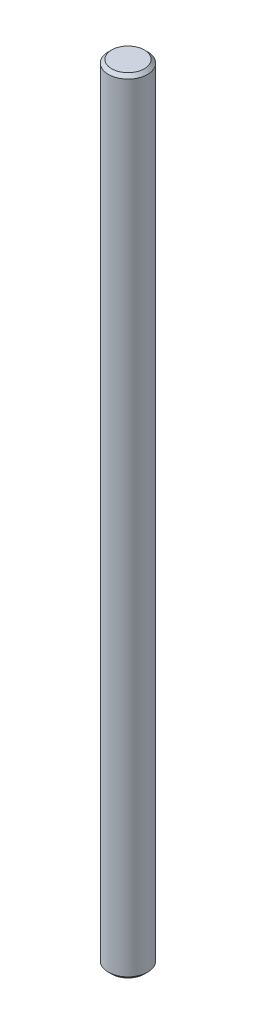
ISO-10303-21;
HEADER;
FILE_DESCRIPTION(('STEP AP214'),'2;1');
FILE_NAME('part.step','',(''),(''),'','','');
FILE_SCHEMA(('AUTOMOTIVE_DESIGN { 1 0 10303 214 1 1 1 1 }'));
ENDSEC;
DATA;
#1=APPLICATION_CONTEXT('core data for automotive mechanical design processes');
#2=APPLICATION_PROTOCOL_DEFINITION('international standard','automotive_design',2000,#1);
#3=PRODUCT_CONTEXT('',#1,'mechanical');
#4=PRODUCT('Part','Part','',(#3));
#5=PRODUCT_RELATED_PRODUCT_CATEGORY('part','',(#4));
#6=PRODUCT_DEFINITION_FORMATION('','',#4);
#7=PRODUCT_DEFINITION_CONTEXT('part definition',#1,'design');
#8=PRODUCT_DEFINITION('design','',#6,#7);
#9=PRODUCT_DEFINITION_SHAPE('','',#8);
#10=(LENGTH_UNIT() NAMED_UNIT(*) SI_UNIT(.MILLI.,.METRE.));
#11=(NAMED_UNIT(*) PLANE_ANGLE_UNIT() SI_UNIT($,.RADIAN.));
#12=(NAMED_UNIT(*) SI_UNIT($,.STERADIAN.) SOLID_ANGLE_UNIT());
#13=UNCERTAINTY_MEASURE_WITH_UNIT(LENGTH_MEASURE(1.E-05),#10,'distance_accuracy_value','');
#14=(GEOMETRIC_REPRESENTATION_CONTEXT(3) GLOBAL_UNCERTAINTY_ASSIGNED_CONTEXT((#13)) GLOBAL_UNIT_ASSIGNED_CONTEXT((#10,
#11,#12)) REPRESENTATION_CONTEXT('',''));
#15=CARTESIAN_POINT('',(0.,0.,0.));
#16=DIRECTION('',(0.,0.,1.));
#17=DIRECTION('',(1.,0.,0.));
#18=AXIS2_PLACEMENT_3D('',#15,#16,#17);
#19=CARTESIAN_POINT('',(0.,240.,-0.0104188651304302));
#20=DIRECTION('',(0.,-1.,0.));
#21=DIRECTION('',(0.,0.,-1.));
#22=AXIS2_PLACEMENT_3D('',#19,#20,#21);
#23=CYLINDRICAL_SURFACE('',#22,6.);
#24=CARTESIAN_POINT('',(0.,239.,-0.0104188651304302));
#25=DIRECTION('',(0.,1.,0.));
#26=DIRECTION('',(0.,0.,1.));
#27=AXIS2_PLACEMENT_3D('',#24,#25,#26);
#28=CIRCLE('',#27,6.);
#29=CARTESIAN_POINT('',(0.,239.,5.98958113486957));
#30=VERTEX_POINT('',#29);
#31=EDGE_CURVE('E37',#30,#30,#28,.F.);
#32=ORIENTED_EDGE('',*,*,#31,.T.);
#33=EDGE_LOOP('',(#32));
#34=FACE_BOUND('',#33,.T.);
#35=CARTESIAN_POINT('',(0.,0.999999999999945,-0.0104188651304302));
#36=DIRECTION('',(0.,1.,0.));
#37=DIRECTION('',(0.,0.,1.));
#38=AXIS2_PLACEMENT_3D('',#35,#36,#37);
#39=CIRCLE('',#38,6.);
#40=CARTESIAN_POINT('',(0.,0.999999999999945,5.98958113486957));
#41=VERTEX_POINT('',#40);
#42=EDGE_CURVE('E41',#41,#41,#39,.T.);
#43=ORIENTED_EDGE('',*,*,#42,.T.);
#44=EDGE_LOOP('',(#43));
#45=FACE_BOUND('',#44,.T.);
#46=ADVANCED_FACE('F30',(#34,#45),#23,.T.);
#47=CARTESIAN_POINT('',(0.,240.,-0.0104188651304302));
#48=DIRECTION('',(0.,1.,0.));
#49=DIRECTION('',(0.,0.,1.));
#50=AXIS2_PLACEMENT_3D('',#47,#48,#49);
#51=PLANE('',#50);
#52=CARTESIAN_POINT('',(0.,240.,-0.0104188651304302));
#53=DIRECTION('',(0.,1.,0.));
#54=DIRECTION('',(0.,0.,1.));
#55=AXIS2_PLACEMENT_3D('',#52,#53,#54);
#56=CIRCLE('',#55,5.00000000000003);
#57=CARTESIAN_POINT('',(0.,240.,4.9895811348696));
#58=VERTEX_POINT('',#57);
#59=EDGE_CURVE('E45',#58,#58,#56,.T.);
#60=ORIENTED_EDGE('',*,*,#59,.T.);
#61=EDGE_LOOP('',(#60));
#62=FACE_BOUND('',#61,.T.);
#63=ADVANCED_FACE('F51',(#62),#51,.T.);
#64=CARTESIAN_POINT('',(0.,0.,-0.0104188651304302));
#65=DIRECTION('',(0.,1.,0.));
#66=DIRECTION('',(0.,0.,1.));
#67=AXIS2_PLACEMENT_3D('',#64,#65,#66);
#68=PLANE('',#67);
#69=CARTESIAN_POINT('',(0.,0.,-0.0104188651304302));
#70=DIRECTION('',(0.,1.,0.));
#71=DIRECTION('',(0.,0.,1.));
#72=AXIS2_PLACEMENT_3D('',#69,#70,#71);
#73=CIRCLE('',#72,5.00000000000003);
#74=CARTESIAN_POINT('',(0.,0.,4.9895811348696));
#75=VERTEX_POINT('',#74);
#76=EDGE_CURVE('E10',#75,#75,#73,.F.);
#77=ORIENTED_EDGE('',*,*,#76,.T.);
#78=EDGE_LOOP('',(#77));
#79=FACE_BOUND('',#78,.T.);
#80=ADVANCED_FACE('F55',(#79),#68,.F.);
#81=CARTESIAN_POINT('',(0.,240.,-0.0104188651304302));
#82=DIRECTION('',(0.,-1.,0.));
#83=DIRECTION('',(0.,0.,-1.));
#84=AXIS2_PLACEMENT_3D('',#81,#82,#83);
#85=CONICAL_SURFACE('',#84,5.00000000000003,0.785398163397432);
#86=ORIENTED_EDGE('',*,*,#31,.F.);
#87=EDGE_LOOP('',(#86));
#88=FACE_BOUND('',#87,.T.);
#89=ORIENTED_EDGE('',*,*,#59,.F.);
#90=EDGE_LOOP('',(#89));
#91=FACE_BOUND('',#90,.T.);
#92=ADVANCED_FACE('F53',(#88,#91),#85,.T.);
#93=CARTESIAN_POINT('',(0.,0.999999999999945,-0.0104188651304302));
#94=DIRECTION('',(0.,1.,0.));
#95=DIRECTION('',(0.,0.,1.));
#96=AXIS2_PLACEMENT_3D('',#93,#94,#95);
#97=CONICAL_SURFACE('',#96,6.,0.78539816339746);
#98=ORIENTED_EDGE('',*,*,#76,.F.);
#99=EDGE_LOOP('',(#98));
#100=FACE_BOUND('',#99,.T.);
#101=ORIENTED_EDGE('',*,*,#42,.F.);
#102=EDGE_LOOP('',(#101));
#103=FACE_BOUND('',#102,.T.);
#104=ADVANCED_FACE('F32',(#100,#103),#97,.T.);
#105=CLOSED_SHELL('',(#46,#63,#80,#92,#104));
#106=MANIFOLD_SOLID_BREP('B2',#105);
#107=ADVANCED_BREP_SHAPE_REPRESENTATION('',(#18,#106),#14);
#108=SHAPE_DEFINITION_REPRESENTATION(#9,#107);
ENDSEC;
END-ISO-10303-21;
